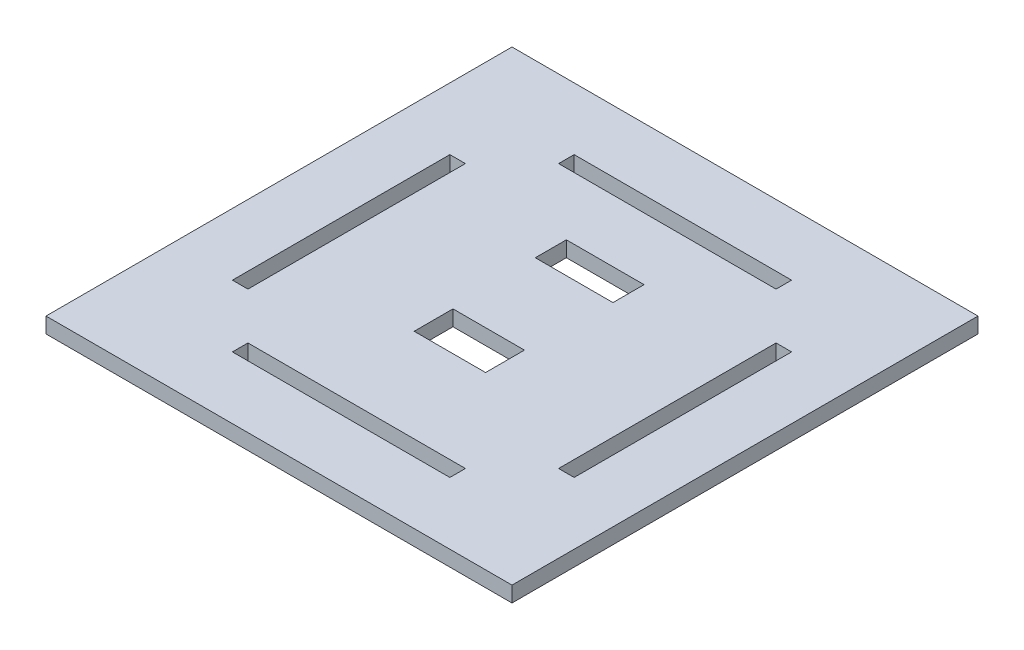
ISO-10303-21;
HEADER;
FILE_DESCRIPTION(('STEP AP214'),'2;1');
FILE_NAME('part.step','',(''),(''),'','','');
FILE_SCHEMA(('AUTOMOTIVE_DESIGN { 1 0 10303 214 1 1 1 1 }'));
ENDSEC;
DATA;
#1=APPLICATION_CONTEXT('core data for automotive mechanical design processes');
#2=APPLICATION_PROTOCOL_DEFINITION('international standard','automotive_design',2000,#1);
#3=PRODUCT_CONTEXT('',#1,'mechanical');
#4=PRODUCT('Part','Part','',(#3));
#5=PRODUCT_RELATED_PRODUCT_CATEGORY('part','',(#4));
#6=PRODUCT_DEFINITION_FORMATION('','',#4);
#7=PRODUCT_DEFINITION_CONTEXT('part definition',#1,'design');
#8=PRODUCT_DEFINITION('design','',#6,#7);
#9=PRODUCT_DEFINITION_SHAPE('','',#8);
#10=(LENGTH_UNIT() NAMED_UNIT(*) SI_UNIT(.MILLI.,.METRE.));
#11=(NAMED_UNIT(*) PLANE_ANGLE_UNIT() SI_UNIT($,.RADIAN.));
#12=(NAMED_UNIT(*) SI_UNIT($,.STERADIAN.) SOLID_ANGLE_UNIT());
#13=UNCERTAINTY_MEASURE_WITH_UNIT(LENGTH_MEASURE(1.E-05),#10,'distance_accuracy_value','');
#14=(GEOMETRIC_REPRESENTATION_CONTEXT(3) GLOBAL_UNCERTAINTY_ASSIGNED_CONTEXT((#13)) GLOBAL_UNIT_ASSIGNED_CONTEXT((#10,
#11,#12)) REPRESENTATION_CONTEXT('',''));
#15=CARTESIAN_POINT('',(0.,0.,0.));
#16=DIRECTION('',(0.,0.,1.));
#17=DIRECTION('',(1.,0.,0.));
#18=AXIS2_PLACEMENT_3D('',#15,#16,#17);
#19=CARTESIAN_POINT('',(0.,5.,0.));
#20=DIRECTION('',(0.,1.,0.));
#21=DIRECTION('',(0.,0.,1.));
#22=AXIS2_PLACEMENT_3D('',#19,#20,#21);
#23=PLANE('',#22);
#24=DIRECTION('',(0.,0.,-1.));
#25=VECTOR('',#24,1.);
#26=CARTESIAN_POINT('',(0.,5.,0.));
#27=LINE('',#26,#25);
#28=CARTESIAN_POINT('',(0.,5.,0.));
#29=VERTEX_POINT('',#28);
#30=CARTESIAN_POINT('',(0.,5.,-150.));
#31=VERTEX_POINT('',#30);
#32=EDGE_CURVE('E488',#29,#31,#27,.T.);
#33=ORIENTED_EDGE('',*,*,#32,.T.);
#34=DIRECTION('',(-1.,0.,0.));
#35=VECTOR('',#34,1.);
#36=CARTESIAN_POINT('',(0.,5.,-150.));
#37=LINE('',#36,#35);
#38=CARTESIAN_POINT('',(-150.,5.,-150.));
#39=VERTEX_POINT('',#38);
#40=EDGE_CURVE('E492',#31,#39,#37,.T.);
#41=ORIENTED_EDGE('',*,*,#40,.T.);
#42=DIRECTION('',(0.,0.,1.));
#43=VECTOR('',#42,1.);
#44=CARTESIAN_POINT('',(-150.,5.,0.));
#45=LINE('',#44,#43);
#46=CARTESIAN_POINT('',(-150.,5.,0.));
#47=VERTEX_POINT('',#46);
#48=EDGE_CURVE('E496',#39,#47,#45,.T.);
#49=ORIENTED_EDGE('',*,*,#48,.T.);
#50=DIRECTION('',(1.,0.,0.));
#51=VECTOR('',#50,1.);
#52=CARTESIAN_POINT('',(0.,5.,0.));
#53=LINE('',#52,#51);
#54=EDGE_CURVE('E499',#47,#29,#53,.T.);
#55=ORIENTED_EDGE('',*,*,#54,.T.);
#56=EDGE_LOOP('',(#33,#41,#49,#55));
#57=FACE_BOUND('',#56,.T.);
#58=DIRECTION('',(1.,0.,0.));
#59=VECTOR('',#58,1.);
#60=CARTESIAN_POINT('',(-86.5,5.,-55.));
#61=LINE('',#60,#59);
#62=CARTESIAN_POINT('',(-86.5,5.,-55.));
#63=VERTEX_POINT('',#62);
#64=CARTESIAN_POINT('',(-63.5,5.,-55.));
#65=VERTEX_POINT('',#64);
#66=EDGE_CURVE('E448',#63,#65,#61,.T.);
#67=ORIENTED_EDGE('',*,*,#66,.F.);
#68=DIRECTION('',(0.,0.,1.));
#69=VECTOR('',#68,1.);
#70=CARTESIAN_POINT('',(-86.5,5.,-67.5));
#71=LINE('',#70,#69);
#72=CARTESIAN_POINT('',(-86.5,5.,-67.5));
#73=VERTEX_POINT('',#72);
#74=EDGE_CURVE('E445',#73,#63,#71,.T.);
#75=ORIENTED_EDGE('',*,*,#74,.F.);
#76=DIRECTION('',(-1.,0.,0.));
#77=VECTOR('',#76,1.);
#78=CARTESIAN_POINT('',(-86.5,5.,-67.5));
#79=LINE('',#78,#77);
#80=CARTESIAN_POINT('',(-63.5,5.,-67.5));
#81=VERTEX_POINT('',#80);
#82=EDGE_CURVE('E456',#81,#73,#79,.T.);
#83=ORIENTED_EDGE('',*,*,#82,.F.);
#84=DIRECTION('',(0.,0.,-1.));
#85=VECTOR('',#84,1.);
#86=CARTESIAN_POINT('',(-63.5,5.,-67.5));
#87=LINE('',#86,#85);
#88=EDGE_CURVE('E452',#65,#81,#87,.T.);
#89=ORIENTED_EDGE('',*,*,#88,.F.);
#90=EDGE_LOOP('',(#67,#75,#83,#89));
#91=FACE_BOUND('',#90,.T.);
#92=DIRECTION('',(1.,0.,0.));
#93=VECTOR('',#92,1.);
#94=CARTESIAN_POINT('',(-110.,5.,-125.));
#95=LINE('',#94,#93);
#96=CARTESIAN_POINT('',(-110.,5.,-125.));
#97=VERTEX_POINT('',#96);
#98=CARTESIAN_POINT('',(-39.9999999999999,5.,-125.));
#99=VERTEX_POINT('',#98);
#100=EDGE_CURVE('E405',#97,#99,#95,.T.);
#101=ORIENTED_EDGE('',*,*,#100,.F.);
#102=DIRECTION('',(0.,0.,1.));
#103=VECTOR('',#102,1.);
#104=CARTESIAN_POINT('',(-110.,5.,-130.));
#105=LINE('',#104,#103);
#106=CARTESIAN_POINT('',(-110.,5.,-130.));
#107=VERTEX_POINT('',#106);
#108=EDGE_CURVE('E402',#107,#97,#105,.T.);
#109=ORIENTED_EDGE('',*,*,#108,.F.);
#110=DIRECTION('',(-1.,0.,0.));
#111=VECTOR('',#110,1.);
#112=CARTESIAN_POINT('',(-110.,5.,-130.));
#113=LINE('',#112,#111);
#114=CARTESIAN_POINT('',(-40.,5.,-130.));
#115=VERTEX_POINT('',#114);
#116=EDGE_CURVE('E413',#115,#107,#113,.T.);
#117=ORIENTED_EDGE('',*,*,#116,.F.);
#118=DIRECTION('',(0.,0.,-1.));
#119=VECTOR('',#118,1.);
#120=CARTESIAN_POINT('',(-40.,5.,-130.));
#121=LINE('',#120,#119);
#122=EDGE_CURVE('E409',#99,#115,#121,.T.);
#123=ORIENTED_EDGE('',*,*,#122,.F.);
#124=EDGE_LOOP('',(#101,#109,#117,#123));
#125=FACE_BOUND('',#124,.T.);
#126=DIRECTION('',(-1.,0.,0.));
#127=VECTOR('',#126,1.);
#128=CARTESIAN_POINT('',(-19.9999999999999,5.,-110.));
#129=LINE('',#128,#127);
#130=CARTESIAN_POINT('',(-19.9999999999999,5.,-110.));
#131=VERTEX_POINT('',#130);
#132=CARTESIAN_POINT('',(-25.0000000000001,5.,-110.));
#133=VERTEX_POINT('',#132);
#134=EDGE_CURVE('E362',#131,#133,#129,.T.);
#135=ORIENTED_EDGE('',*,*,#134,.F.);
#136=DIRECTION('',(0.,0.,-1.));
#137=VECTOR('',#136,1.);
#138=CARTESIAN_POINT('',(-19.9999999999999,5.,-110.));
#139=LINE('',#138,#137);
#140=CARTESIAN_POINT('',(-20.0000000000001,5.,-40.));
#141=VERTEX_POINT('',#140);
#142=EDGE_CURVE('E359',#141,#131,#139,.T.);
#143=ORIENTED_EDGE('',*,*,#142,.F.);
#144=DIRECTION('',(1.,0.,0.));
#145=VECTOR('',#144,1.);
#146=CARTESIAN_POINT('',(-20.0000000000001,5.,-40.));
#147=LINE('',#146,#145);
#148=CARTESIAN_POINT('',(-25.0000000000001,5.,-40.));
#149=VERTEX_POINT('',#148);
#150=EDGE_CURVE('E370',#149,#141,#147,.T.);
#151=ORIENTED_EDGE('',*,*,#150,.F.);
#152=DIRECTION('',(0.,0.,1.));
#153=VECTOR('',#152,1.);
#154=CARTESIAN_POINT('',(-25.0000000000001,5.,-110.));
#155=LINE('',#154,#153);
#156=EDGE_CURVE('E366',#133,#149,#155,.T.);
#157=ORIENTED_EDGE('',*,*,#156,.F.);
#158=EDGE_LOOP('',(#135,#143,#151,#157));
#159=FACE_BOUND('',#158,.T.);
#160=DIRECTION('',(1.,0.,0.));
#161=VECTOR('',#160,1.);
#162=CARTESIAN_POINT('',(-87.5000000000001,5.,-95.));
#163=LINE('',#162,#161);
#164=CARTESIAN_POINT('',(-87.5000000000001,5.,-95.));
#165=VERTEX_POINT('',#164);
#166=CARTESIAN_POINT('',(-62.5000000000001,5.,-94.9999999999999));
#167=VERTEX_POINT('',#166);
#168=EDGE_CURVE('E319',#165,#167,#163,.T.);
#169=ORIENTED_EDGE('',*,*,#168,.F.);
#170=DIRECTION('',(0.,0.,1.));
#171=VECTOR('',#170,1.);
#172=CARTESIAN_POINT('',(-87.5000000000001,5.,-105.));
#173=LINE('',#172,#171);
#174=CARTESIAN_POINT('',(-87.5000000000001,5.,-105.));
#175=VERTEX_POINT('',#174);
#176=EDGE_CURVE('E316',#175,#165,#173,.T.);
#177=ORIENTED_EDGE('',*,*,#176,.F.);
#178=DIRECTION('',(-1.,0.,0.));
#179=VECTOR('',#178,1.);
#180=CARTESIAN_POINT('',(-87.5000000000001,5.,-105.));
#181=LINE('',#180,#179);
#182=CARTESIAN_POINT('',(-62.5000000000001,5.,-105.));
#183=VERTEX_POINT('',#182);
#184=EDGE_CURVE('E327',#183,#175,#181,.T.);
#185=ORIENTED_EDGE('',*,*,#184,.F.);
#186=DIRECTION('',(0.,0.,-1.));
#187=VECTOR('',#186,1.);
#188=CARTESIAN_POINT('',(-62.5000000000001,5.,-105.));
#189=LINE('',#188,#187);
#190=EDGE_CURVE('E323',#167,#183,#189,.T.);
#191=ORIENTED_EDGE('',*,*,#190,.F.);
#192=EDGE_LOOP('',(#169,#177,#185,#191));
#193=FACE_BOUND('',#192,.T.);
#194=DIRECTION('',(-1.,0.,0.));
#195=VECTOR('',#194,1.);
#196=CARTESIAN_POINT('',(-125.,5.,-110.));
#197=LINE('',#196,#195);
#198=CARTESIAN_POINT('',(-125.,5.,-110.));
#199=VERTEX_POINT('',#198);
#200=CARTESIAN_POINT('',(-130.,5.,-110.));
#201=VERTEX_POINT('',#200);
#202=EDGE_CURVE('E276',#199,#201,#197,.T.);
#203=ORIENTED_EDGE('',*,*,#202,.F.);
#204=DIRECTION('',(0.,0.,-1.));
#205=VECTOR('',#204,1.);
#206=CARTESIAN_POINT('',(-125.,5.,-110.));
#207=LINE('',#206,#205);
#208=CARTESIAN_POINT('',(-125.,5.,-40.));
#209=VERTEX_POINT('',#208);
#210=EDGE_CURVE('E273',#209,#199,#207,.T.);
#211=ORIENTED_EDGE('',*,*,#210,.F.);
#212=DIRECTION('',(1.,0.,0.));
#213=VECTOR('',#212,1.);
#214=CARTESIAN_POINT('',(-125.,5.,-40.));
#215=LINE('',#214,#213);
#216=CARTESIAN_POINT('',(-130.,5.,-40.));
#217=VERTEX_POINT('',#216);
#218=EDGE_CURVE('E284',#217,#209,#215,.T.);
#219=ORIENTED_EDGE('',*,*,#218,.F.);
#220=DIRECTION('',(0.,0.,1.));
#221=VECTOR('',#220,1.);
#222=CARTESIAN_POINT('',(-130.,5.,-110.));
#223=LINE('',#222,#221);
#224=EDGE_CURVE('E280',#201,#217,#223,.T.);
#225=ORIENTED_EDGE('',*,*,#224,.F.);
#226=EDGE_LOOP('',(#203,#211,#219,#225));
#227=FACE_BOUND('',#226,.T.);
#228=DIRECTION('',(1.,0.,0.));
#229=VECTOR('',#228,1.);
#230=CARTESIAN_POINT('',(-110.,5.,-20.));
#231=LINE('',#230,#229);
#232=CARTESIAN_POINT('',(-110.,5.,-20.));
#233=VERTEX_POINT('',#232);
#234=CARTESIAN_POINT('',(-40.,5.,-20.));
#235=VERTEX_POINT('',#234);
#236=EDGE_CURVE('E234',#233,#235,#231,.T.);
#237=ORIENTED_EDGE('',*,*,#236,.F.);
#238=DIRECTION('',(0.,0.,1.));
#239=VECTOR('',#238,1.);
#240=CARTESIAN_POINT('',(-110.,5.,-20.));
#241=LINE('',#240,#239);
#242=CARTESIAN_POINT('',(-110.,5.,-25.));
#243=VERTEX_POINT('',#242);
#244=EDGE_CURVE('E225',#243,#233,#241,.T.);
#245=ORIENTED_EDGE('',*,*,#244,.F.);
#246=DIRECTION('',(-1.,0.,0.));
#247=VECTOR('',#246,1.);
#248=CARTESIAN_POINT('',(-110.,5.,-25.));
#249=LINE('',#248,#247);
#250=CARTESIAN_POINT('',(-40.,5.,-25.));
#251=VERTEX_POINT('',#250);
#252=EDGE_CURVE('E251',#251,#243,#249,.T.);
#253=ORIENTED_EDGE('',*,*,#252,.F.);
#254=DIRECTION('',(0.,0.,-1.));
#255=VECTOR('',#254,1.);
#256=CARTESIAN_POINT('',(-40.,5.,-20.));
#257=LINE('',#256,#255);
#258=EDGE_CURVE('E247',#235,#251,#257,.T.);
#259=ORIENTED_EDGE('',*,*,#258,.F.);
#260=EDGE_LOOP('',(#237,#245,#253,#259));
#261=FACE_BOUND('',#260,.T.);
#262=ADVANCED_FACE('F39',(#57,#91,#125,#159,#193,#227,#261),#23,.T.);
#263=CARTESIAN_POINT('',(0.,0.,0.));
#264=DIRECTION('',(0.,1.,0.));
#265=DIRECTION('',(0.,0.,1.));
#266=AXIS2_PLACEMENT_3D('',#263,#264,#265);
#267=PLANE('',#266);
#268=DIRECTION('',(0.,0.,-1.));
#269=VECTOR('',#268,1.);
#270=CARTESIAN_POINT('',(-125.,0.,-110.));
#271=LINE('',#270,#269);
#272=CARTESIAN_POINT('',(-125.,0.,-40.));
#273=VERTEX_POINT('',#272);
#274=CARTESIAN_POINT('',(-125.,0.,-110.));
#275=VERTEX_POINT('',#274);
#276=EDGE_CURVE('E243',#273,#275,#271,.T.);
#277=ORIENTED_EDGE('',*,*,#276,.T.);
#278=DIRECTION('',(-1.,0.,0.));
#279=VECTOR('',#278,1.);
#280=CARTESIAN_POINT('',(-125.,0.,-110.));
#281=LINE('',#280,#279);
#282=CARTESIAN_POINT('',(-130.,0.,-110.));
#283=VERTEX_POINT('',#282);
#284=EDGE_CURVE('E291',#275,#283,#281,.T.);
#285=ORIENTED_EDGE('',*,*,#284,.T.);
#286=DIRECTION('',(0.,0.,1.));
#287=VECTOR('',#286,1.);
#288=CARTESIAN_POINT('',(-130.,0.,-110.));
#289=LINE('',#288,#287);
#290=CARTESIAN_POINT('',(-130.,0.,-40.));
#291=VERTEX_POINT('',#290);
#292=EDGE_CURVE('E295',#283,#291,#289,.T.);
#293=ORIENTED_EDGE('',*,*,#292,.T.);
#294=DIRECTION('',(1.,0.,0.));
#295=VECTOR('',#294,1.);
#296=CARTESIAN_POINT('',(-125.,0.,-40.));
#297=LINE('',#296,#295);
#298=EDGE_CURVE('E277',#291,#273,#297,.T.);
#299=ORIENTED_EDGE('',*,*,#298,.T.);
#300=EDGE_LOOP('',(#277,#285,#293,#299));
#301=FACE_BOUND('',#300,.T.);
#302=DIRECTION('',(0.,0.,-1.));
#303=VECTOR('',#302,1.);
#304=CARTESIAN_POINT('',(-19.9999999999999,0.,-110.));
#305=LINE('',#304,#303);
#306=CARTESIAN_POINT('',(-20.0000000000001,0.,-40.));
#307=VERTEX_POINT('',#306);
#308=CARTESIAN_POINT('',(-19.9999999999999,0.,-110.));
#309=VERTEX_POINT('',#308);
#310=EDGE_CURVE('E358',#307,#309,#305,.T.);
#311=ORIENTED_EDGE('',*,*,#310,.T.);
#312=DIRECTION('',(-1.,0.,0.));
#313=VECTOR('',#312,1.);
#314=CARTESIAN_POINT('',(-19.9999999999999,0.,-110.));
#315=LINE('',#314,#313);
#316=CARTESIAN_POINT('',(-25.0000000000001,0.,-110.));
#317=VERTEX_POINT('',#316);
#318=EDGE_CURVE('E377',#309,#317,#315,.T.);
#319=ORIENTED_EDGE('',*,*,#318,.T.);
#320=DIRECTION('',(0.,0.,1.));
#321=VECTOR('',#320,1.);
#322=CARTESIAN_POINT('',(-25.0000000000001,0.,-110.));
#323=LINE('',#322,#321);
#324=CARTESIAN_POINT('',(-25.0000000000001,0.,-40.));
#325=VERTEX_POINT('',#324);
#326=EDGE_CURVE('E381',#317,#325,#323,.T.);
#327=ORIENTED_EDGE('',*,*,#326,.T.);
#328=DIRECTION('',(1.,0.,0.));
#329=VECTOR('',#328,1.);
#330=CARTESIAN_POINT('',(-20.0000000000001,0.,-40.));
#331=LINE('',#330,#329);
#332=EDGE_CURVE('E363',#325,#307,#331,.T.);
#333=ORIENTED_EDGE('',*,*,#332,.T.);
#334=EDGE_LOOP('',(#311,#319,#327,#333));
#335=FACE_BOUND('',#334,.T.);
#336=DIRECTION('',(0.,0.,1.));
#337=VECTOR('',#336,1.);
#338=CARTESIAN_POINT('',(-86.5,0.,-67.5));
#339=LINE('',#338,#337);
#340=CARTESIAN_POINT('',(-86.5,0.,-67.5));
#341=VERTEX_POINT('',#340);
#342=CARTESIAN_POINT('',(-86.5,0.,-55.));
#343=VERTEX_POINT('',#342);
#344=EDGE_CURVE('E444',#341,#343,#339,.T.);
#345=ORIENTED_EDGE('',*,*,#344,.T.);
#346=DIRECTION('',(1.,0.,0.));
#347=VECTOR('',#346,1.);
#348=CARTESIAN_POINT('',(-86.5,0.,-55.));
#349=LINE('',#348,#347);
#350=CARTESIAN_POINT('',(-63.5,0.,-55.));
#351=VERTEX_POINT('',#350);
#352=EDGE_CURVE('E463',#343,#351,#349,.T.);
#353=ORIENTED_EDGE('',*,*,#352,.T.);
#354=DIRECTION('',(0.,0.,-1.));
#355=VECTOR('',#354,1.);
#356=CARTESIAN_POINT('',(-63.5,0.,-67.5));
#357=LINE('',#356,#355);
#358=CARTESIAN_POINT('',(-63.5,0.,-67.5));
#359=VERTEX_POINT('',#358);
#360=EDGE_CURVE('E467',#351,#359,#357,.T.);
#361=ORIENTED_EDGE('',*,*,#360,.T.);
#362=DIRECTION('',(-1.,0.,0.));
#363=VECTOR('',#362,1.);
#364=CARTESIAN_POINT('',(-86.5,0.,-67.5));
#365=LINE('',#364,#363);
#366=EDGE_CURVE('E449',#359,#341,#365,.T.);
#367=ORIENTED_EDGE('',*,*,#366,.T.);
#368=EDGE_LOOP('',(#345,#353,#361,#367));
#369=FACE_BOUND('',#368,.T.);
#370=DIRECTION('',(0.,0.,-1.));
#371=VECTOR('',#370,1.);
#372=CARTESIAN_POINT('',(0.,0.,0.));
#373=LINE('',#372,#371);
#374=CARTESIAN_POINT('',(0.,0.,0.));
#375=VERTEX_POINT('',#374);
#376=CARTESIAN_POINT('',(0.,0.,-150.));
#377=VERTEX_POINT('',#376);
#378=EDGE_CURVE('E487',#375,#377,#373,.T.);
#379=ORIENTED_EDGE('',*,*,#378,.F.);
#380=DIRECTION('',(1.,0.,0.));
#381=VECTOR('',#380,1.);
#382=CARTESIAN_POINT('',(0.,0.,0.));
#383=LINE('',#382,#381);
#384=CARTESIAN_POINT('',(-150.,0.,0.));
#385=VERTEX_POINT('',#384);
#386=EDGE_CURVE('E493',#385,#375,#383,.T.);
#387=ORIENTED_EDGE('',*,*,#386,.F.);
#388=DIRECTION('',(0.,0.,1.));
#389=VECTOR('',#388,1.);
#390=CARTESIAN_POINT('',(-150.,0.,0.));
#391=LINE('',#390,#389);
#392=CARTESIAN_POINT('',(-150.,0.,-150.));
#393=VERTEX_POINT('',#392);
#394=EDGE_CURVE('E509',#393,#385,#391,.T.);
#395=ORIENTED_EDGE('',*,*,#394,.F.);
#396=DIRECTION('',(-1.,0.,0.));
#397=VECTOR('',#396,1.);
#398=CARTESIAN_POINT('',(0.,0.,-150.));
#399=LINE('',#398,#397);
#400=EDGE_CURVE('E506',#377,#393,#399,.T.);
#401=ORIENTED_EDGE('',*,*,#400,.F.);
#402=EDGE_LOOP('',(#379,#387,#395,#401));
#403=FACE_BOUND('',#402,.T.);
#404=DIRECTION('',(0.,0.,1.));
#405=VECTOR('',#404,1.);
#406=CARTESIAN_POINT('',(-110.,0.,-130.));
#407=LINE('',#406,#405);
#408=CARTESIAN_POINT('',(-110.,0.,-130.));
#409=VERTEX_POINT('',#408);
#410=CARTESIAN_POINT('',(-110.,0.,-125.));
#411=VERTEX_POINT('',#410);
#412=EDGE_CURVE('E401',#409,#411,#407,.T.);
#413=ORIENTED_EDGE('',*,*,#412,.T.);
#414=DIRECTION('',(1.,0.,0.));
#415=VECTOR('',#414,1.);
#416=CARTESIAN_POINT('',(-110.,0.,-125.));
#417=LINE('',#416,#415);
#418=CARTESIAN_POINT('',(-39.9999999999999,0.,-125.));
#419=VERTEX_POINT('',#418);
#420=EDGE_CURVE('E420',#411,#419,#417,.T.);
#421=ORIENTED_EDGE('',*,*,#420,.T.);
#422=DIRECTION('',(0.,0.,-1.));
#423=VECTOR('',#422,1.);
#424=CARTESIAN_POINT('',(-40.,0.,-130.));
#425=LINE('',#424,#423);
#426=CARTESIAN_POINT('',(-40.,0.,-130.));
#427=VERTEX_POINT('',#426);
#428=EDGE_CURVE('E424',#419,#427,#425,.T.);
#429=ORIENTED_EDGE('',*,*,#428,.T.);
#430=DIRECTION('',(-1.,0.,0.));
#431=VECTOR('',#430,1.);
#432=CARTESIAN_POINT('',(-110.,0.,-130.));
#433=LINE('',#432,#431);
#434=EDGE_CURVE('E406',#427,#409,#433,.T.);
#435=ORIENTED_EDGE('',*,*,#434,.T.);
#436=EDGE_LOOP('',(#413,#421,#429,#435));
#437=FACE_BOUND('',#436,.T.);
#438=DIRECTION('',(0.,0.,1.));
#439=VECTOR('',#438,1.);
#440=CARTESIAN_POINT('',(-87.5000000000001,0.,-105.));
#441=LINE('',#440,#439);
#442=CARTESIAN_POINT('',(-87.5000000000001,0.,-105.));
#443=VERTEX_POINT('',#442);
#444=CARTESIAN_POINT('',(-87.5000000000001,0.,-95.));
#445=VERTEX_POINT('',#444);
#446=EDGE_CURVE('E315',#443,#445,#441,.T.);
#447=ORIENTED_EDGE('',*,*,#446,.T.);
#448=DIRECTION('',(1.,0.,0.));
#449=VECTOR('',#448,1.);
#450=CARTESIAN_POINT('',(-87.5000000000001,0.,-95.));
#451=LINE('',#450,#449);
#452=CARTESIAN_POINT('',(-62.5000000000001,0.,-94.9999999999999));
#453=VERTEX_POINT('',#452);
#454=EDGE_CURVE('E334',#445,#453,#451,.T.);
#455=ORIENTED_EDGE('',*,*,#454,.T.);
#456=DIRECTION('',(0.,0.,-1.));
#457=VECTOR('',#456,1.);
#458=CARTESIAN_POINT('',(-62.5000000000001,0.,-105.));
#459=LINE('',#458,#457);
#460=CARTESIAN_POINT('',(-62.5000000000001,0.,-105.));
#461=VERTEX_POINT('',#460);
#462=EDGE_CURVE('E338',#453,#461,#459,.T.);
#463=ORIENTED_EDGE('',*,*,#462,.T.);
#464=DIRECTION('',(-1.,0.,0.));
#465=VECTOR('',#464,1.);
#466=CARTESIAN_POINT('',(-87.5000000000001,0.,-105.));
#467=LINE('',#466,#465);
#468=EDGE_CURVE('E320',#461,#443,#467,.T.);
#469=ORIENTED_EDGE('',*,*,#468,.T.);
#470=EDGE_LOOP('',(#447,#455,#463,#469));
#471=FACE_BOUND('',#470,.T.);
#472=DIRECTION('',(0.,0.,1.));
#473=VECTOR('',#472,1.);
#474=CARTESIAN_POINT('',(-110.,0.,-20.));
#475=LINE('',#474,#473);
#476=CARTESIAN_POINT('',(-110.,0.,-25.));
#477=VERTEX_POINT('',#476);
#478=CARTESIAN_POINT('',(-110.,0.,-20.));
#479=VERTEX_POINT('',#478);
#480=EDGE_CURVE('E63',#477,#479,#475,.T.);
#481=ORIENTED_EDGE('',*,*,#480,.T.);
#482=DIRECTION('',(1.,0.,0.));
#483=VECTOR('',#482,1.);
#484=CARTESIAN_POINT('',(-110.,0.,-20.));
#485=LINE('',#484,#483);
#486=CARTESIAN_POINT('',(-40.,0.,-20.));
#487=VERTEX_POINT('',#486);
#488=EDGE_CURVE('E241',#479,#487,#485,.T.);
#489=ORIENTED_EDGE('',*,*,#488,.T.);
#490=DIRECTION('',(0.,0.,-1.));
#491=VECTOR('',#490,1.);
#492=CARTESIAN_POINT('',(-40.,0.,-20.));
#493=LINE('',#492,#491);
#494=CARTESIAN_POINT('',(-40.,0.,-25.));
#495=VERTEX_POINT('',#494);
#496=EDGE_CURVE('E260',#487,#495,#493,.T.);
#497=ORIENTED_EDGE('',*,*,#496,.T.);
#498=DIRECTION('',(-1.,0.,0.));
#499=VECTOR('',#498,1.);
#500=CARTESIAN_POINT('',(-110.,0.,-25.));
#501=LINE('',#500,#499);
#502=EDGE_CURVE('E235',#495,#477,#501,.T.);
#503=ORIENTED_EDGE('',*,*,#502,.T.);
#504=EDGE_LOOP('',(#481,#489,#497,#503));
#505=FACE_BOUND('',#504,.T.);
#506=ADVANCED_FACE('F532',(#301,#335,#369,#403,#437,#471,#505),#267,.F.);
#507=CARTESIAN_POINT('',(0.,5.,0.));
#508=DIRECTION('',(-1.,0.,0.));
#509=DIRECTION('',(0.,0.,1.));
#510=AXIS2_PLACEMENT_3D('',#507,#508,#509);
#511=PLANE('',#510);
#512=ORIENTED_EDGE('',*,*,#378,.T.);
#513=DIRECTION('',(0.,-1.,0.));
#514=VECTOR('',#513,1.);
#515=CARTESIAN_POINT('',(0.,5.,-150.));
#516=LINE('',#515,#514);
#517=EDGE_CURVE('E11',#31,#377,#516,.T.);
#518=ORIENTED_EDGE('',*,*,#517,.F.);
#519=ORIENTED_EDGE('',*,*,#32,.F.);
#520=DIRECTION('',(0.,-1.,0.));
#521=VECTOR('',#520,1.);
#522=CARTESIAN_POINT('',(0.,5.,0.));
#523=LINE('',#522,#521);
#524=EDGE_CURVE('E502',#29,#375,#523,.T.);
#525=ORIENTED_EDGE('',*,*,#524,.T.);
#526=EDGE_LOOP('',(#512,#518,#519,#525));
#527=FACE_BOUND('',#526,.T.);
#528=ADVANCED_FACE('F41',(#527),#511,.F.);
#529=CARTESIAN_POINT('',(0.,5.,-150.));
#530=DIRECTION('',(0.,0.,1.));
#531=DIRECTION('',(1.,0.,0.));
#532=AXIS2_PLACEMENT_3D('',#529,#530,#531);
#533=PLANE('',#532);
#534=ORIENTED_EDGE('',*,*,#400,.T.);
#535=DIRECTION('',(0.,-1.,0.));
#536=VECTOR('',#535,1.);
#537=CARTESIAN_POINT('',(-150.,5.,-150.));
#538=LINE('',#537,#536);
#539=EDGE_CURVE('E48',#39,#393,#538,.T.);
#540=ORIENTED_EDGE('',*,*,#539,.F.);
#541=ORIENTED_EDGE('',*,*,#40,.F.);
#542=ORIENTED_EDGE('',*,*,#517,.T.);
#543=EDGE_LOOP('',(#534,#540,#541,#542));
#544=FACE_BOUND('',#543,.T.);
#545=ADVANCED_FACE('F543',(#544),#533,.F.);
#546=CARTESIAN_POINT('',(-150.,5.,0.));
#547=DIRECTION('',(1.,0.,0.));
#548=DIRECTION('',(0.,0.,-1.));
#549=AXIS2_PLACEMENT_3D('',#546,#547,#548);
#550=PLANE('',#549);
#551=ORIENTED_EDGE('',*,*,#394,.T.);
#552=DIRECTION('',(0.,-1.,0.));
#553=VECTOR('',#552,1.);
#554=CARTESIAN_POINT('',(-150.,5.,0.));
#555=LINE('',#554,#553);
#556=EDGE_CURVE('E517',#47,#385,#555,.T.);
#557=ORIENTED_EDGE('',*,*,#556,.F.);
#558=ORIENTED_EDGE('',*,*,#48,.F.);
#559=ORIENTED_EDGE('',*,*,#539,.T.);
#560=EDGE_LOOP('',(#551,#557,#558,#559));
#561=FACE_BOUND('',#560,.T.);
#562=ADVANCED_FACE('F526',(#561),#550,.F.);
#563=CARTESIAN_POINT('',(0.,5.,0.));
#564=DIRECTION('',(0.,0.,-1.));
#565=DIRECTION('',(-1.,0.,0.));
#566=AXIS2_PLACEMENT_3D('',#563,#564,#565);
#567=PLANE('',#566);
#568=ORIENTED_EDGE('',*,*,#386,.T.);
#569=ORIENTED_EDGE('',*,*,#524,.F.);
#570=ORIENTED_EDGE('',*,*,#54,.F.);
#571=ORIENTED_EDGE('',*,*,#556,.T.);
#572=EDGE_LOOP('',(#568,#569,#570,#571));
#573=FACE_BOUND('',#572,.T.);
#574=ADVANCED_FACE('F536',(#573),#567,.F.);
#575=CARTESIAN_POINT('',(-86.5,5.,-67.5));
#576=DIRECTION('',(1.,0.,0.));
#577=DIRECTION('',(0.,0.,-1.));
#578=AXIS2_PLACEMENT_3D('',#575,#576,#577);
#579=PLANE('',#578);
#580=ORIENTED_EDGE('',*,*,#344,.F.);
#581=DIRECTION('',(0.,-1.,0.));
#582=VECTOR('',#581,1.);
#583=CARTESIAN_POINT('',(-86.5,5.,-67.5));
#584=LINE('',#583,#582);
#585=EDGE_CURVE('E459',#73,#341,#584,.T.);
#586=ORIENTED_EDGE('',*,*,#585,.F.);
#587=ORIENTED_EDGE('',*,*,#74,.T.);
#588=DIRECTION('',(0.,-1.,0.));
#589=VECTOR('',#588,1.);
#590=CARTESIAN_POINT('',(-86.5,5.,-55.));
#591=LINE('',#590,#589);
#592=EDGE_CURVE('E483',#63,#343,#591,.T.);
#593=ORIENTED_EDGE('',*,*,#592,.T.);
#594=EDGE_LOOP('',(#580,#586,#587,#593));
#595=FACE_BOUND('',#594,.T.);
#596=ADVANCED_FACE('F558',(#595),#579,.T.);
#597=CARTESIAN_POINT('',(-86.5,5.,-55.));
#598=DIRECTION('',(0.,0.,-1.));
#599=DIRECTION('',(-1.,0.,0.));
#600=AXIS2_PLACEMENT_3D('',#597,#598,#599);
#601=PLANE('',#600);
#602=ORIENTED_EDGE('',*,*,#352,.F.);
#603=ORIENTED_EDGE('',*,*,#592,.F.);
#604=ORIENTED_EDGE('',*,*,#66,.T.);
#605=DIRECTION('',(0.,-1.,0.));
#606=VECTOR('',#605,1.);
#607=CARTESIAN_POINT('',(-63.5,5.,-55.));
#608=LINE('',#607,#606);
#609=EDGE_CURVE('E480',#65,#351,#608,.T.);
#610=ORIENTED_EDGE('',*,*,#609,.T.);
#611=EDGE_LOOP('',(#602,#603,#604,#610));
#612=FACE_BOUND('',#611,.T.);
#613=ADVANCED_FACE('F565',(#612),#601,.T.);
#614=CARTESIAN_POINT('',(-63.5,5.,-67.5));
#615=DIRECTION('',(-1.,0.,0.));
#616=DIRECTION('',(0.,0.,1.));
#617=AXIS2_PLACEMENT_3D('',#614,#615,#616);
#618=PLANE('',#617);
#619=ORIENTED_EDGE('',*,*,#360,.F.);
#620=ORIENTED_EDGE('',*,*,#609,.F.);
#621=ORIENTED_EDGE('',*,*,#88,.T.);
#622=DIRECTION('',(0.,-1.,0.));
#623=VECTOR('',#622,1.);
#624=CARTESIAN_POINT('',(-63.5,5.,-67.5));
#625=LINE('',#624,#623);
#626=EDGE_CURVE('E477',#81,#359,#625,.T.);
#627=ORIENTED_EDGE('',*,*,#626,.T.);
#628=EDGE_LOOP('',(#619,#620,#621,#627));
#629=FACE_BOUND('',#628,.T.);
#630=ADVANCED_FACE('F570',(#629),#618,.T.);
#631=CARTESIAN_POINT('',(-86.5,5.,-67.5));
#632=DIRECTION('',(0.,0.,1.));
#633=DIRECTION('',(1.,0.,0.));
#634=AXIS2_PLACEMENT_3D('',#631,#632,#633);
#635=PLANE('',#634);
#636=ORIENTED_EDGE('',*,*,#366,.F.);
#637=ORIENTED_EDGE('',*,*,#626,.F.);
#638=ORIENTED_EDGE('',*,*,#82,.T.);
#639=ORIENTED_EDGE('',*,*,#585,.T.);
#640=EDGE_LOOP('',(#636,#637,#638,#639));
#641=FACE_BOUND('',#640,.T.);
#642=ADVANCED_FACE('F578',(#641),#635,.T.);
#643=CARTESIAN_POINT('',(-110.,5.,-130.));
#644=DIRECTION('',(1.,0.,0.));
#645=DIRECTION('',(0.,0.,-1.));
#646=AXIS2_PLACEMENT_3D('',#643,#644,#645);
#647=PLANE('',#646);
#648=ORIENTED_EDGE('',*,*,#412,.F.);
#649=DIRECTION('',(0.,-1.,0.));
#650=VECTOR('',#649,1.);
#651=CARTESIAN_POINT('',(-110.,5.,-130.));
#652=LINE('',#651,#650);
#653=EDGE_CURVE('E416',#107,#409,#652,.T.);
#654=ORIENTED_EDGE('',*,*,#653,.F.);
#655=ORIENTED_EDGE('',*,*,#108,.T.);
#656=DIRECTION('',(0.,-1.,0.));
#657=VECTOR('',#656,1.);
#658=CARTESIAN_POINT('',(-110.,5.,-125.));
#659=LINE('',#658,#657);
#660=EDGE_CURVE('E440',#97,#411,#659,.T.);
#661=ORIENTED_EDGE('',*,*,#660,.T.);
#662=EDGE_LOOP('',(#648,#654,#655,#661));
#663=FACE_BOUND('',#662,.T.);
#664=ADVANCED_FACE('F673',(#663),#647,.T.);
#665=CARTESIAN_POINT('',(-110.,5.,-125.));
#666=DIRECTION('',(0.,0.,-1.));
#667=DIRECTION('',(-1.,0.,0.));
#668=AXIS2_PLACEMENT_3D('',#665,#666,#667);
#669=PLANE('',#668);
#670=ORIENTED_EDGE('',*,*,#420,.F.);
#671=ORIENTED_EDGE('',*,*,#660,.F.);
#672=ORIENTED_EDGE('',*,*,#100,.T.);
#673=DIRECTION('',(0.,-1.,0.));
#674=VECTOR('',#673,1.);
#675=CARTESIAN_POINT('',(-39.9999999999999,5.,-125.));
#676=LINE('',#675,#674);
#677=EDGE_CURVE('E437',#99,#419,#676,.T.);
#678=ORIENTED_EDGE('',*,*,#677,.T.);
#679=EDGE_LOOP('',(#670,#671,#672,#678));
#680=FACE_BOUND('',#679,.T.);
#681=ADVANCED_FACE('F669',(#680),#669,.T.);
#682=CARTESIAN_POINT('',(-40.,5.,-130.));
#683=DIRECTION('',(-1.,0.,0.));
#684=DIRECTION('',(0.,0.,1.));
#685=AXIS2_PLACEMENT_3D('',#682,#683,#684);
#686=PLANE('',#685);
#687=ORIENTED_EDGE('',*,*,#428,.F.);
#688=ORIENTED_EDGE('',*,*,#677,.F.);
#689=ORIENTED_EDGE('',*,*,#122,.T.);
#690=DIRECTION('',(0.,-1.,0.));
#691=VECTOR('',#690,1.);
#692=CARTESIAN_POINT('',(-40.,5.,-130.));
#693=LINE('',#692,#691);
#694=EDGE_CURVE('E434',#115,#427,#693,.T.);
#695=ORIENTED_EDGE('',*,*,#694,.T.);
#696=EDGE_LOOP('',(#687,#688,#689,#695));
#697=FACE_BOUND('',#696,.T.);
#698=ADVANCED_FACE('F665',(#697),#686,.T.);
#699=CARTESIAN_POINT('',(-110.,5.,-130.));
#700=DIRECTION('',(0.,0.,1.));
#701=DIRECTION('',(1.,0.,0.));
#702=AXIS2_PLACEMENT_3D('',#699,#700,#701);
#703=PLANE('',#702);
#704=ORIENTED_EDGE('',*,*,#434,.F.);
#705=ORIENTED_EDGE('',*,*,#694,.F.);
#706=ORIENTED_EDGE('',*,*,#116,.T.);
#707=ORIENTED_EDGE('',*,*,#653,.T.);
#708=EDGE_LOOP('',(#704,#705,#706,#707));
#709=FACE_BOUND('',#708,.T.);
#710=ADVANCED_FACE('F661',(#709),#703,.T.);
#711=CARTESIAN_POINT('',(-19.9999999999999,5.,-110.));
#712=DIRECTION('',(-1.,0.,0.));
#713=DIRECTION('',(0.,0.,1.));
#714=AXIS2_PLACEMENT_3D('',#711,#712,#713);
#715=PLANE('',#714);
#716=ORIENTED_EDGE('',*,*,#310,.F.);
#717=DIRECTION('',(0.,-1.,0.));
#718=VECTOR('',#717,1.);
#719=CARTESIAN_POINT('',(-20.0000000000001,5.,-40.));
#720=LINE('',#719,#718);
#721=EDGE_CURVE('E373',#141,#307,#720,.T.);
#722=ORIENTED_EDGE('',*,*,#721,.F.);
#723=ORIENTED_EDGE('',*,*,#142,.T.);
#724=DIRECTION('',(0.,-1.,0.));
#725=VECTOR('',#724,1.);
#726=CARTESIAN_POINT('',(-19.9999999999999,5.,-110.));
#727=LINE('',#726,#725);
#728=EDGE_CURVE('E397',#131,#309,#727,.T.);
#729=ORIENTED_EDGE('',*,*,#728,.T.);
#730=EDGE_LOOP('',(#716,#722,#723,#729));
#731=FACE_BOUND('',#730,.T.);
#732=ADVANCED_FACE('F657',(#731),#715,.T.);
#733=CARTESIAN_POINT('',(-19.9999999999999,5.,-110.));
#734=DIRECTION('',(0.,0.,1.));
#735=DIRECTION('',(1.,0.,0.));
#736=AXIS2_PLACEMENT_3D('',#733,#734,#735);
#737=PLANE('',#736);
#738=ORIENTED_EDGE('',*,*,#318,.F.);
#739=ORIENTED_EDGE('',*,*,#728,.F.);
#740=ORIENTED_EDGE('',*,*,#134,.T.);
#741=DIRECTION('',(0.,-1.,0.));
#742=VECTOR('',#741,1.);
#743=CARTESIAN_POINT('',(-25.0000000000001,5.,-110.));
#744=LINE('',#743,#742);
#745=EDGE_CURVE('E394',#133,#317,#744,.T.);
#746=ORIENTED_EDGE('',*,*,#745,.T.);
#747=EDGE_LOOP('',(#738,#739,#740,#746));
#748=FACE_BOUND('',#747,.T.);
#749=ADVANCED_FACE('F653',(#748),#737,.T.);
#750=CARTESIAN_POINT('',(-25.0000000000001,5.,-110.));
#751=DIRECTION('',(1.,0.,0.));
#752=DIRECTION('',(0.,0.,-1.));
#753=AXIS2_PLACEMENT_3D('',#750,#751,#752);
#754=PLANE('',#753);
#755=ORIENTED_EDGE('',*,*,#326,.F.);
#756=ORIENTED_EDGE('',*,*,#745,.F.);
#757=ORIENTED_EDGE('',*,*,#156,.T.);
#758=DIRECTION('',(0.,-1.,0.));
#759=VECTOR('',#758,1.);
#760=CARTESIAN_POINT('',(-25.0000000000001,5.,-40.));
#761=LINE('',#760,#759);
#762=EDGE_CURVE('E391',#149,#325,#761,.T.);
#763=ORIENTED_EDGE('',*,*,#762,.T.);
#764=EDGE_LOOP('',(#755,#756,#757,#763));
#765=FACE_BOUND('',#764,.T.);
#766=ADVANCED_FACE('F649',(#765),#754,.T.);
#767=CARTESIAN_POINT('',(-20.0000000000001,5.,-40.));
#768=DIRECTION('',(0.,0.,-1.));
#769=DIRECTION('',(-1.,0.,0.));
#770=AXIS2_PLACEMENT_3D('',#767,#768,#769);
#771=PLANE('',#770);
#772=ORIENTED_EDGE('',*,*,#332,.F.);
#773=ORIENTED_EDGE('',*,*,#762,.F.);
#774=ORIENTED_EDGE('',*,*,#150,.T.);
#775=ORIENTED_EDGE('',*,*,#721,.T.);
#776=EDGE_LOOP('',(#772,#773,#774,#775));
#777=FACE_BOUND('',#776,.T.);
#778=ADVANCED_FACE('F645',(#777),#771,.T.);
#779=CARTESIAN_POINT('',(-87.5000000000001,5.,-105.));
#780=DIRECTION('',(1.,0.,0.));
#781=DIRECTION('',(0.,0.,-1.));
#782=AXIS2_PLACEMENT_3D('',#779,#780,#781);
#783=PLANE('',#782);
#784=ORIENTED_EDGE('',*,*,#446,.F.);
#785=DIRECTION('',(0.,-1.,0.));
#786=VECTOR('',#785,1.);
#787=CARTESIAN_POINT('',(-87.5000000000001,5.,-105.));
#788=LINE('',#787,#786);
#789=EDGE_CURVE('E330',#175,#443,#788,.T.);
#790=ORIENTED_EDGE('',*,*,#789,.F.);
#791=ORIENTED_EDGE('',*,*,#176,.T.);
#792=DIRECTION('',(0.,-1.,0.));
#793=VECTOR('',#792,1.);
#794=CARTESIAN_POINT('',(-87.5000000000001,5.,-95.));
#795=LINE('',#794,#793);
#796=EDGE_CURVE('E354',#165,#445,#795,.T.);
#797=ORIENTED_EDGE('',*,*,#796,.T.);
#798=EDGE_LOOP('',(#784,#790,#791,#797));
#799=FACE_BOUND('',#798,.T.);
#800=ADVANCED_FACE('F641',(#799),#783,.T.);
#801=CARTESIAN_POINT('',(-87.5000000000001,5.,-95.));
#802=DIRECTION('',(0.,0.,-1.));
#803=DIRECTION('',(-1.,0.,0.));
#804=AXIS2_PLACEMENT_3D('',#801,#802,#803);
#805=PLANE('',#804);
#806=ORIENTED_EDGE('',*,*,#454,.F.);
#807=ORIENTED_EDGE('',*,*,#796,.F.);
#808=ORIENTED_EDGE('',*,*,#168,.T.);
#809=DIRECTION('',(0.,-1.,0.));
#810=VECTOR('',#809,1.);
#811=CARTESIAN_POINT('',(-62.5000000000001,5.,-94.9999999999999));
#812=LINE('',#811,#810);
#813=EDGE_CURVE('E351',#167,#453,#812,.T.);
#814=ORIENTED_EDGE('',*,*,#813,.T.);
#815=EDGE_LOOP('',(#806,#807,#808,#814));
#816=FACE_BOUND('',#815,.T.);
#817=ADVANCED_FACE('F637',(#816),#805,.T.);
#818=CARTESIAN_POINT('',(-62.5000000000001,5.,-105.));
#819=DIRECTION('',(-1.,0.,0.));
#820=DIRECTION('',(0.,0.,1.));
#821=AXIS2_PLACEMENT_3D('',#818,#819,#820);
#822=PLANE('',#821);
#823=ORIENTED_EDGE('',*,*,#462,.F.);
#824=ORIENTED_EDGE('',*,*,#813,.F.);
#825=ORIENTED_EDGE('',*,*,#190,.T.);
#826=DIRECTION('',(0.,-1.,0.));
#827=VECTOR('',#826,1.);
#828=CARTESIAN_POINT('',(-62.5000000000001,5.,-105.));
#829=LINE('',#828,#827);
#830=EDGE_CURVE('E348',#183,#461,#829,.T.);
#831=ORIENTED_EDGE('',*,*,#830,.T.);
#832=EDGE_LOOP('',(#823,#824,#825,#831));
#833=FACE_BOUND('',#832,.T.);
#834=ADVANCED_FACE('F633',(#833),#822,.T.);
#835=CARTESIAN_POINT('',(-87.5000000000001,5.,-105.));
#836=DIRECTION('',(0.,0.,1.));
#837=DIRECTION('',(1.,0.,0.));
#838=AXIS2_PLACEMENT_3D('',#835,#836,#837);
#839=PLANE('',#838);
#840=ORIENTED_EDGE('',*,*,#468,.F.);
#841=ORIENTED_EDGE('',*,*,#830,.F.);
#842=ORIENTED_EDGE('',*,*,#184,.T.);
#843=ORIENTED_EDGE('',*,*,#789,.T.);
#844=EDGE_LOOP('',(#840,#841,#842,#843));
#845=FACE_BOUND('',#844,.T.);
#846=ADVANCED_FACE('F630',(#845),#839,.T.);
#847=CARTESIAN_POINT('',(-125.,5.,-110.));
#848=DIRECTION('',(-1.,0.,0.));
#849=DIRECTION('',(0.,0.,1.));
#850=AXIS2_PLACEMENT_3D('',#847,#848,#849);
#851=PLANE('',#850);
#852=ORIENTED_EDGE('',*,*,#276,.F.);
#853=DIRECTION('',(0.,-1.,0.));
#854=VECTOR('',#853,1.);
#855=CARTESIAN_POINT('',(-125.,5.,-40.));
#856=LINE('',#855,#854);
#857=EDGE_CURVE('E287',#209,#273,#856,.T.);
#858=ORIENTED_EDGE('',*,*,#857,.F.);
#859=ORIENTED_EDGE('',*,*,#210,.T.);
#860=DIRECTION('',(0.,-1.,0.));
#861=VECTOR('',#860,1.);
#862=CARTESIAN_POINT('',(-125.,5.,-110.));
#863=LINE('',#862,#861);
#864=EDGE_CURVE('E311',#199,#275,#863,.T.);
#865=ORIENTED_EDGE('',*,*,#864,.T.);
#866=EDGE_LOOP('',(#852,#858,#859,#865));
#867=FACE_BOUND('',#866,.T.);
#868=ADVANCED_FACE('F612',(#867),#851,.T.);
#869=CARTESIAN_POINT('',(-125.,5.,-110.));
#870=DIRECTION('',(0.,0.,1.));
#871=DIRECTION('',(1.,0.,0.));
#872=AXIS2_PLACEMENT_3D('',#869,#870,#871);
#873=PLANE('',#872);
#874=ORIENTED_EDGE('',*,*,#284,.F.);
#875=ORIENTED_EDGE('',*,*,#864,.F.);
#876=ORIENTED_EDGE('',*,*,#202,.T.);
#877=DIRECTION('',(0.,-1.,0.));
#878=VECTOR('',#877,1.);
#879=CARTESIAN_POINT('',(-130.,5.,-110.));
#880=LINE('',#879,#878);
#881=EDGE_CURVE('E308',#201,#283,#880,.T.);
#882=ORIENTED_EDGE('',*,*,#881,.T.);
#883=EDGE_LOOP('',(#874,#875,#876,#882));
#884=FACE_BOUND('',#883,.T.);
#885=ADVANCED_FACE('F605',(#884),#873,.T.);
#886=CARTESIAN_POINT('',(-130.,5.,-110.));
#887=DIRECTION('',(1.,0.,0.));
#888=DIRECTION('',(0.,0.,-1.));
#889=AXIS2_PLACEMENT_3D('',#886,#887,#888);
#890=PLANE('',#889);
#891=ORIENTED_EDGE('',*,*,#292,.F.);
#892=ORIENTED_EDGE('',*,*,#881,.F.);
#893=ORIENTED_EDGE('',*,*,#224,.T.);
#894=DIRECTION('',(0.,-1.,0.));
#895=VECTOR('',#894,1.);
#896=CARTESIAN_POINT('',(-130.,5.,-40.));
#897=LINE('',#896,#895);
#898=EDGE_CURVE('E305',#217,#291,#897,.T.);
#899=ORIENTED_EDGE('',*,*,#898,.T.);
#900=EDGE_LOOP('',(#891,#892,#893,#899));
#901=FACE_BOUND('',#900,.T.);
#902=ADVANCED_FACE('F608',(#901),#890,.T.);
#903=CARTESIAN_POINT('',(-125.,5.,-40.));
#904=DIRECTION('',(0.,0.,-1.));
#905=DIRECTION('',(-1.,0.,0.));
#906=AXIS2_PLACEMENT_3D('',#903,#904,#905);
#907=PLANE('',#906);
#908=ORIENTED_EDGE('',*,*,#298,.F.);
#909=ORIENTED_EDGE('',*,*,#898,.F.);
#910=ORIENTED_EDGE('',*,*,#218,.T.);
#911=ORIENTED_EDGE('',*,*,#857,.T.);
#912=EDGE_LOOP('',(#908,#909,#910,#911));
#913=FACE_BOUND('',#912,.T.);
#914=ADVANCED_FACE('F615',(#913),#907,.T.);
#915=CARTESIAN_POINT('',(-110.,5.,-20.));
#916=DIRECTION('',(1.,0.,0.));
#917=DIRECTION('',(0.,0.,-1.));
#918=AXIS2_PLACEMENT_3D('',#915,#916,#917);
#919=PLANE('',#918);
#920=ORIENTED_EDGE('',*,*,#480,.F.);
#921=DIRECTION('',(0.,-1.,0.));
#922=VECTOR('',#921,1.);
#923=CARTESIAN_POINT('',(-110.,5.,-25.));
#924=LINE('',#923,#922);
#925=EDGE_CURVE('E229',#243,#477,#924,.T.);
#926=ORIENTED_EDGE('',*,*,#925,.F.);
#927=ORIENTED_EDGE('',*,*,#244,.T.);
#928=DIRECTION('',(0.,-1.,0.));
#929=VECTOR('',#928,1.);
#930=CARTESIAN_POINT('',(-110.,5.,-20.));
#931=LINE('',#930,#929);
#932=EDGE_CURVE('E228',#233,#479,#931,.T.);
#933=ORIENTED_EDGE('',*,*,#932,.T.);
#934=EDGE_LOOP('',(#920,#926,#927,#933));
#935=FACE_BOUND('',#934,.T.);
#936=ADVANCED_FACE('F227',(#935),#919,.T.);
#937=CARTESIAN_POINT('',(-110.,5.,-20.));
#938=DIRECTION('',(0.,0.,-1.));
#939=DIRECTION('',(-1.,0.,0.));
#940=AXIS2_PLACEMENT_3D('',#937,#938,#939);
#941=PLANE('',#940);
#942=ORIENTED_EDGE('',*,*,#488,.F.);
#943=ORIENTED_EDGE('',*,*,#932,.F.);
#944=ORIENTED_EDGE('',*,*,#236,.T.);
#945=DIRECTION('',(0.,-1.,0.));
#946=VECTOR('',#945,1.);
#947=CARTESIAN_POINT('',(-40.,5.,-20.));
#948=LINE('',#947,#946);
#949=EDGE_CURVE('E244',#235,#487,#948,.T.);
#950=ORIENTED_EDGE('',*,*,#949,.T.);
#951=EDGE_LOOP('',(#942,#943,#944,#950));
#952=FACE_BOUND('',#951,.T.);
#953=ADVANCED_FACE('F238',(#952),#941,.T.);
#954=CARTESIAN_POINT('',(-40.,5.,-20.));
#955=DIRECTION('',(-1.,0.,0.));
#956=DIRECTION('',(0.,0.,1.));
#957=AXIS2_PLACEMENT_3D('',#954,#955,#956);
#958=PLANE('',#957);
#959=ORIENTED_EDGE('',*,*,#496,.F.);
#960=ORIENTED_EDGE('',*,*,#949,.F.);
#961=ORIENTED_EDGE('',*,*,#258,.T.);
#962=DIRECTION('',(0.,-1.,0.));
#963=VECTOR('',#962,1.);
#964=CARTESIAN_POINT('',(-40.,5.,-25.));
#965=LINE('',#964,#963);
#966=EDGE_CURVE('E55',#251,#495,#965,.T.);
#967=ORIENTED_EDGE('',*,*,#966,.T.);
#968=EDGE_LOOP('',(#959,#960,#961,#967));
#969=FACE_BOUND('',#968,.T.);
#970=ADVANCED_FACE('F768',(#969),#958,.T.);
#971=CARTESIAN_POINT('',(-110.,5.,-25.));
#972=DIRECTION('',(0.,0.,1.));
#973=DIRECTION('',(1.,0.,0.));
#974=AXIS2_PLACEMENT_3D('',#971,#972,#973);
#975=PLANE('',#974);
#976=ORIENTED_EDGE('',*,*,#502,.F.);
#977=ORIENTED_EDGE('',*,*,#966,.F.);
#978=ORIENTED_EDGE('',*,*,#252,.T.);
#979=ORIENTED_EDGE('',*,*,#925,.T.);
#980=EDGE_LOOP('',(#976,#977,#978,#979));
#981=FACE_BOUND('',#980,.T.);
#982=ADVANCED_FACE('F776',(#981),#975,.T.);
#983=CLOSED_SHELL('',(#262,#506,#528,#545,#562,#574,#596,#613,#630,#642,#664,#681,#698,#710,
#732,#749,#766,#778,#800,#817,#834,#846,#868,#885,#902,#914,#936,#953,#970,#982));
#984=MANIFOLD_SOLID_BREP('B2',#983);
#985=ADVANCED_BREP_SHAPE_REPRESENTATION('',(#18,#984),#14);
#986=SHAPE_DEFINITION_REPRESENTATION(#9,#985);
ENDSEC;
END-ISO-10303-21;
